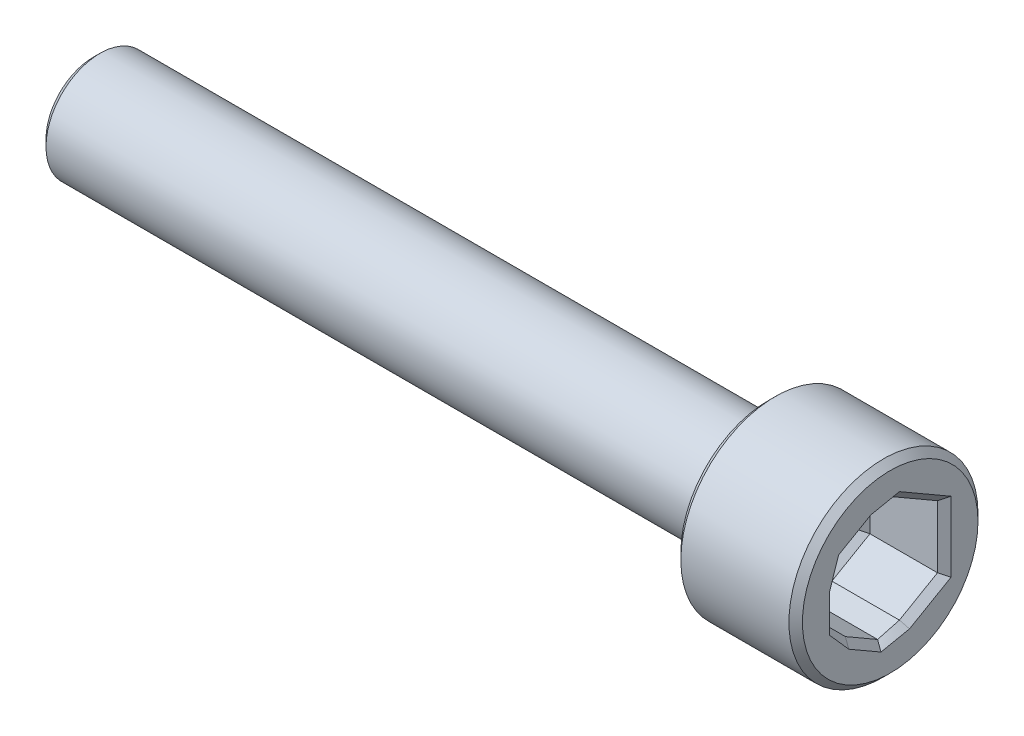
ISO-10303-21;
HEADER;
FILE_DESCRIPTION(('STEP AP214'),'2;1');
FILE_NAME('part.step','',(''),(''),'','','');
FILE_SCHEMA(('AUTOMOTIVE_DESIGN { 1 0 10303 214 1 1 1 1 }'));
ENDSEC;
DATA;
#1=APPLICATION_CONTEXT('core data for automotive mechanical design processes');
#2=APPLICATION_PROTOCOL_DEFINITION('international standard','automotive_design',2000,#1);
#3=PRODUCT_CONTEXT('',#1,'mechanical');
#4=PRODUCT('Part','Part','',(#3));
#5=PRODUCT_RELATED_PRODUCT_CATEGORY('part','',(#4));
#6=PRODUCT_DEFINITION_FORMATION('','',#4);
#7=PRODUCT_DEFINITION_CONTEXT('part definition',#1,'design');
#8=PRODUCT_DEFINITION('design','',#6,#7);
#9=PRODUCT_DEFINITION_SHAPE('','',#8);
#10=(LENGTH_UNIT() NAMED_UNIT(*) SI_UNIT(.MILLI.,.METRE.));
#11=(NAMED_UNIT(*) PLANE_ANGLE_UNIT() SI_UNIT($,.RADIAN.));
#12=(NAMED_UNIT(*) SI_UNIT($,.STERADIAN.) SOLID_ANGLE_UNIT());
#13=UNCERTAINTY_MEASURE_WITH_UNIT(LENGTH_MEASURE(1.E-05),#10,'distance_accuracy_value','');
#14=(GEOMETRIC_REPRESENTATION_CONTEXT(3) GLOBAL_UNCERTAINTY_ASSIGNED_CONTEXT((#13)) GLOBAL_UNIT_ASSIGNED_CONTEXT((#10,
#11,#12)) REPRESENTATION_CONTEXT('',''));
#15=CARTESIAN_POINT('',(0.,0.,0.));
#16=DIRECTION('',(0.,0.,1.));
#17=DIRECTION('',(1.,0.,0.));
#18=AXIS2_PLACEMENT_3D('',#15,#16,#17);
#19=CARTESIAN_POINT('',(0.,0.,-3.5));
#20=DIRECTION('',(1.,0.,0.));
#21=DIRECTION('',(0.,0.,-1.));
#22=AXIS2_PLACEMENT_3D('',#19,#20,#21);
#23=PLANE('',#22);
#24=DIRECTION('',(0.,-1.,0.));
#25=VECTOR('',#24,1.);
#26=CARTESIAN_POINT('',(0.,-1.15470053837925,-2.25));
#27=LINE('',#26,#25);
#28=CARTESIAN_POINT('',(0.,1.29903810567666,-2.25));
#29=VERTEX_POINT('',#28);
#30=CARTESIAN_POINT('',(0.,-1.29903810567666,-2.25));
#31=VERTEX_POINT('',#30);
#32=EDGE_CURVE('E261',#29,#31,#27,.T.);
#33=ORIENTED_EDGE('',*,*,#32,.T.);
#34=DIRECTION('',(0.,-0.5,0.866025403784439));
#35=VECTOR('',#34,1.);
#36=CARTESIAN_POINT('',(0.,-2.52590742770461,-0.124999999999999));
#37=LINE('',#36,#35);
#38=CARTESIAN_POINT('',(0.,-2.18440107675849,-0.716506350946128));
#39=VERTEX_POINT('',#38);
#40=EDGE_CURVE('E269',#31,#39,#37,.T.);
#41=ORIENTED_EDGE('',*,*,#40,.T.);
#42=CARTESIAN_POINT('',(0.,-2.40090742770461,0.341506350946112));
#43=CARTESIAN_POINT('',(0.,-2.37728058948551,0.22604786747843));
#44=CARTESIAN_POINT('',(0.,-2.35365375126641,0.110589384010747));
#45=CARTESIAN_POINT('',(0.,-2.30575594033251,-0.123475308038468));
#46=CARTESIAN_POINT('',(0.,-2.28148496761771,-0.24208151662));
#47=CARTESIAN_POINT('',(0.,-2.2329430221881,-0.479293933783064));
#48=CARTESIAN_POINT('',(0.,-2.2086720494733,-0.597900142364596));
#49=CARTESIAN_POINT('',(0.,-2.18440107675849,-0.716506350946128));
#50=B_SPLINE_CURVE_WITH_KNOTS('',3,(#42,#43,#44,#45,#46,#47,#48,#49),.UNSPECIFIED.,.F.,.F.,(4,2,
2,4),(0.,0.353553390593272,0.7167456474979,1.07993790440253),.UNSPECIFIED.);
#51=CARTESIAN_POINT('',(0.,-2.40090742770461,0.341506350946112));
#52=VERTEX_POINT('',#51);
#53=EDGE_CURVE('E263',#52,#39,#50,.T.);
#54=ORIENTED_EDGE('',*,*,#53,.F.);
#55=DIRECTION('',(0.,0.5,0.866025403784439));
#56=VECTOR('',#55,1.);
#57=CARTESIAN_POINT('',(0.,-1.37120688932536,2.125));
#58=LINE('',#57,#56);
#59=CARTESIAN_POINT('',(0.,-1.71271324027148,1.53349364905388));
#60=VERTEX_POINT('',#59);
#61=EDGE_CURVE('E249',#52,#60,#58,.T.);
#62=ORIENTED_EDGE('',*,*,#61,.T.);
#63=CARTESIAN_POINT('',(0.,-0.90470053837925,2.25));
#64=CARTESIAN_POINT('',(0.,-0.992877099035139,2.17180931615731));
#65=CARTESIAN_POINT('',(0.,-1.08105365969103,2.09361863231463));
#66=CARTESIAN_POINT('',(0.,-1.25981072366768,1.9351055652356));
#67=CARTESIAN_POINT('',(0.,-1.35039122698844,1.85478318199925));
#68=CARTESIAN_POINT('',(0.,-1.53155223362996,1.69413841552657));
#69=CARTESIAN_POINT('',(0.,-1.62213273695072,1.61381603229022));
#70=CARTESIAN_POINT('',(0.,-1.71271324027148,1.53349364905388));
#71=B_SPLINE_CURVE_WITH_KNOTS('',3,(#63,#64,#65,#66,#67,#68,#69,#70),.UNSPECIFIED.,.F.,.F.,(4,2,
2,4),(0.,0.353553390593271,0.716745647497895,1.07993790440252),.UNSPECIFIED.);
#72=CARTESIAN_POINT('',(0.,-0.90470053837925,2.25));
#73=VERTEX_POINT('',#72);
#74=EDGE_CURVE('E243',#73,#60,#71,.T.);
#75=ORIENTED_EDGE('',*,*,#74,.F.);
#76=DIRECTION('',(0.,1.,0.));
#77=VECTOR('',#76,1.);
#78=CARTESIAN_POINT('',(0.,1.15470053837925,2.25));
#79=LINE('',#78,#77);
#80=CARTESIAN_POINT('',(0.,0.471687836487016,2.25));
#81=VERTEX_POINT('',#80);
#82=EDGE_CURVE('E216',#73,#81,#79,.T.);
#83=ORIENTED_EDGE('',*,*,#82,.T.);
#84=CARTESIAN_POINT('',(0.,1.49620688932536,1.90849364905389));
#85=CARTESIAN_POINT('',(0.,1.38440349045037,1.94576144867889));
#86=CARTESIAN_POINT('',(0.,1.27260009157538,1.98302924830388));
#87=CARTESIAN_POINT('',(0.,1.04594521666483,2.05858087327406));
#88=CARTESIAN_POINT('',(0.,0.931093740629269,2.09686469861925));
#89=CARTESIAN_POINT('',(0.,0.701390788558143,2.17343234930963));
#90=CARTESIAN_POINT('',(0.,0.586539312522579,2.21171617465481));
#91=CARTESIAN_POINT('',(0.,0.471687836487016,2.25));
#92=B_SPLINE_CURVE_WITH_KNOTS('',3,(#84,#85,#86,#87,#88,#89,#90,#91),.UNSPECIFIED.,.F.,.F.,(4,2,
2,4),(0.,0.353553390593272,0.716745647497897,1.07993790440252),.UNSPECIFIED.);
#93=CARTESIAN_POINT('',(0.,1.49620688932536,1.90849364905389));
#94=VERTEX_POINT('',#93);
#95=EDGE_CURVE('E208',#94,#81,#92,.T.);
#96=ORIENTED_EDGE('',*,*,#95,.F.);
#97=DIRECTION('',(0.,0.5,-0.866025403784439));
#98=VECTOR('',#97,1.);
#99=CARTESIAN_POINT('',(0.,2.52590742770461,0.125));
#100=LINE('',#99,#98);
#101=CARTESIAN_POINT('',(0.,2.1844010767585,0.716506350946118));
#102=VERTEX_POINT('',#101);
#103=EDGE_CURVE('E250',#94,#102,#100,.T.);
#104=ORIENTED_EDGE('',*,*,#103,.T.);
#105=CARTESIAN_POINT('',(0.,2.40090742770461,-0.341506350946108));
#106=CARTESIAN_POINT('',(0.,2.37728058948551,-0.226047867478425));
#107=CARTESIAN_POINT('',(0.,2.35365375126641,-0.110589384010742));
#108=CARTESIAN_POINT('',(0.,2.30575594033251,0.123475308038471));
#109=CARTESIAN_POINT('',(0.,2.28148496761771,0.24208151662));
#110=CARTESIAN_POINT('',(0.,2.2329430221881,0.479293933783059));
#111=CARTESIAN_POINT('',(0.,2.2086720494733,0.597900142364589));
#112=CARTESIAN_POINT('',(0.,2.1844010767585,0.716506350946118));
#113=B_SPLINE_CURVE_WITH_KNOTS('',3,(#105,#106,#107,#108,#109,#110,#111,#112),.UNSPECIFIED.,.F.,
.F.,(4,2,2,4),(0.,0.353553390593272,0.716745647497892,1.07993790440251),.UNSPECIFIED.);
#114=CARTESIAN_POINT('',(0.,2.40090742770461,-0.341506350946108));
#115=VERTEX_POINT('',#114);
#116=EDGE_CURVE('E253',#115,#102,#113,.T.);
#117=ORIENTED_EDGE('',*,*,#116,.F.);
#118=DIRECTION('',(0.,-0.5,-0.866025403784439));
#119=VECTOR('',#118,1.);
#120=CARTESIAN_POINT('',(0.,1.37120688932536,-2.125));
#121=LINE('',#120,#119);
#122=EDGE_CURVE('E259',#115,#29,#121,.T.);
#123=ORIENTED_EDGE('',*,*,#122,.T.);
#124=EDGE_LOOP('',(#33,#41,#54,#62,#75,#83,#96,#104,#117,#123));
#125=FACE_BOUND('',#124,.T.);
#126=CARTESIAN_POINT('',(0.,0.,0.));
#127=DIRECTION('',(1.,0.,0.));
#128=DIRECTION('',(0.,0.,-1.));
#129=AXIS2_PLACEMENT_3D('',#126,#127,#128);
#130=CIRCLE('',#129,3.25);
#131=CARTESIAN_POINT('',(0.,0.,-3.25));
#132=VERTEX_POINT('',#131);
#133=EDGE_CURVE('E205',#132,#132,#130,.T.);
#134=ORIENTED_EDGE('',*,*,#133,.T.);
#135=EDGE_LOOP('',(#134));
#136=FACE_BOUND('',#135,.T.);
#137=ADVANCED_FACE('F32',(#125,#136),#23,.T.);
#138=CARTESIAN_POINT('',(-29.5,0.,0.));
#139=DIRECTION('',(-1.,0.,0.));
#140=DIRECTION('',(0.,0.,1.));
#141=AXIS2_PLACEMENT_3D('',#138,#139,#140);
#142=PLANE('',#141);
#143=CARTESIAN_POINT('',(-29.5,0.,0.));
#144=DIRECTION('',(-1.,0.,0.));
#145=DIRECTION('',(0.,0.,1.));
#146=AXIS2_PLACEMENT_3D('',#143,#144,#145);
#147=CIRCLE('',#146,1.75);
#148=CARTESIAN_POINT('',(-29.5,0.,1.75000000000001));
#149=VERTEX_POINT('',#148);
#150=EDGE_CURVE('E11',#149,#149,#147,.T.);
#151=ORIENTED_EDGE('',*,*,#150,.T.);
#152=EDGE_LOOP('',(#151));
#153=FACE_BOUND('',#152,.T.);
#154=ADVANCED_FACE('F458',(#153),#142,.T.);
#155=CARTESIAN_POINT('',(0.,0.,0.));
#156=DIRECTION('',(1.,0.,0.));
#157=DIRECTION('',(0.,0.,-1.));
#158=AXIS2_PLACEMENT_3D('',#155,#156,#157);
#159=CYLINDRICAL_SURFACE('',#158,2.);
#160=CARTESIAN_POINT('',(-4.75,0.,0.));
#161=DIRECTION('',(-1.,0.,0.));
#162=DIRECTION('',(0.,0.,1.));
#163=AXIS2_PLACEMENT_3D('',#160,#161,#162);
#164=CIRCLE('',#163,2.);
#165=CARTESIAN_POINT('',(-4.75,0.,2.));
#166=VERTEX_POINT('',#165);
#167=EDGE_CURVE('E41',#166,#166,#164,.T.);
#168=ORIENTED_EDGE('',*,*,#167,.T.);
#169=EDGE_LOOP('',(#168));
#170=FACE_BOUND('',#169,.T.);
#171=CARTESIAN_POINT('',(-29.25,0.,0.));
#172=DIRECTION('',(-1.,0.,0.));
#173=DIRECTION('',(0.,0.,1.));
#174=AXIS2_PLACEMENT_3D('',#171,#172,#173);
#175=CIRCLE('',#174,2.);
#176=CARTESIAN_POINT('',(-29.25,0.,2.));
#177=VERTEX_POINT('',#176);
#178=EDGE_CURVE('E538',#177,#177,#175,.F.);
#179=ORIENTED_EDGE('',*,*,#178,.T.);
#180=EDGE_LOOP('',(#179));
#181=FACE_BOUND('',#180,.T.);
#182=ADVANCED_FACE('F463',(#170,#181),#159,.T.);
#183=CARTESIAN_POINT('',(-4.5,0.,-2.));
#184=DIRECTION('',(-1.,0.,0.));
#185=DIRECTION('',(0.,0.,1.));
#186=AXIS2_PLACEMENT_3D('',#183,#184,#185);
#187=PLANE('',#186);
#188=CARTESIAN_POINT('',(-4.5,0.,0.));
#189=DIRECTION('',(-1.,0.,0.));
#190=DIRECTION('',(0.,0.,1.));
#191=AXIS2_PLACEMENT_3D('',#188,#189,#190);
#192=CIRCLE('',#191,3.25);
#193=CARTESIAN_POINT('',(-4.5,0.,3.25));
#194=VERTEX_POINT('',#193);
#195=EDGE_CURVE('E535',#194,#194,#192,.T.);
#196=ORIENTED_EDGE('',*,*,#195,.T.);
#197=EDGE_LOOP('',(#196));
#198=FACE_BOUND('',#197,.T.);
#199=CARTESIAN_POINT('',(-4.5,0.,0.));
#200=DIRECTION('',(-1.,0.,0.));
#201=DIRECTION('',(0.,0.,1.));
#202=AXIS2_PLACEMENT_3D('',#199,#200,#201);
#203=CIRCLE('',#202,2.25);
#204=CARTESIAN_POINT('',(-4.5,0.,2.25));
#205=VERTEX_POINT('',#204);
#206=EDGE_CURVE('E532',#205,#205,#203,.F.);
#207=ORIENTED_EDGE('',*,*,#206,.T.);
#208=EDGE_LOOP('',(#207));
#209=FACE_BOUND('',#208,.T.);
#210=ADVANCED_FACE('F846',(#198,#209),#187,.T.);
#211=CARTESIAN_POINT('',(0.,0.,0.));
#212=DIRECTION('',(1.,0.,0.));
#213=DIRECTION('',(0.,0.,-1.));
#214=AXIS2_PLACEMENT_3D('',#211,#212,#213);
#215=CYLINDRICAL_SURFACE('',#214,3.5);
#216=CARTESIAN_POINT('',(-0.249999999999999,0.,0.));
#217=DIRECTION('',(1.,0.,0.));
#218=DIRECTION('',(0.,0.,-1.));
#219=AXIS2_PLACEMENT_3D('',#216,#217,#218);
#220=CIRCLE('',#219,3.5);
#221=CARTESIAN_POINT('',(-0.25,0.,-3.5));
#222=VERTEX_POINT('',#221);
#223=EDGE_CURVE('E529',#222,#222,#220,.F.);
#224=ORIENTED_EDGE('',*,*,#223,.T.);
#225=EDGE_LOOP('',(#224));
#226=FACE_BOUND('',#225,.T.);
#227=CARTESIAN_POINT('',(-4.25000000000001,0.,0.));
#228=DIRECTION('',(-1.,0.,0.));
#229=DIRECTION('',(0.,0.,1.));
#230=AXIS2_PLACEMENT_3D('',#227,#228,#229);
#231=CIRCLE('',#230,3.5);
#232=CARTESIAN_POINT('',(-4.25000000000001,0.,3.5));
#233=VERTEX_POINT('',#232);
#234=EDGE_CURVE('E526',#233,#233,#231,.F.);
#235=ORIENTED_EDGE('',*,*,#234,.T.);
#236=EDGE_LOOP('',(#235));
#237=FACE_BOUND('',#236,.T.);
#238=ADVANCED_FACE('F838',(#226,#237),#215,.T.);
#239=CARTESIAN_POINT('',(-3.,-1.15470053837925,2.));
#240=DIRECTION('',(0.,-0.866025403784439,0.5));
#241=DIRECTION('',(0.,-0.5,-0.866025403784439));
#242=AXIS2_PLACEMENT_3D('',#239,#240,#241);
#243=PLANE('',#242);
#244=DIRECTION('',(0.,-0.5,-0.866025403784439));
#245=VECTOR('',#244,1.);
#246=CARTESIAN_POINT('',(-0.249999999999996,-2.3094010767585,0.));
#247=LINE('',#246,#245);
#248=CARTESIAN_POINT('',(-0.249999999999995,-1.49620688932537,1.40849364905388));
#249=VERTEX_POINT('',#248);
#250=CARTESIAN_POINT('',(-0.249999999999995,-2.1844010767585,0.216506350946112));
#251=VERTEX_POINT('',#250);
#252=EDGE_CURVE('E171',#249,#251,#247,.T.);
#253=ORIENTED_EDGE('',*,*,#252,.T.);
#254=DIRECTION('',(-1.,0.,0.));
#255=VECTOR('',#254,1.);
#256=CARTESIAN_POINT('',(-3.,-2.1844010767585,0.216506350946113));
#257=LINE('',#256,#255);
#258=CARTESIAN_POINT('',(-2.75,-2.1844010767585,0.216506350946113));
#259=VERTEX_POINT('',#258);
#260=EDGE_CURVE('E169',#251,#259,#257,.T.);
#261=ORIENTED_EDGE('',*,*,#260,.T.);
#262=DIRECTION('',(0.,0.5,0.866025403784439));
#263=VECTOR('',#262,1.);
#264=CARTESIAN_POINT('',(-2.75,-1.15470053837925,2.));
#265=LINE('',#264,#263);
#266=CARTESIAN_POINT('',(-2.75,-1.49620688932537,1.40849364905388));
#267=VERTEX_POINT('',#266);
#268=EDGE_CURVE('E161',#259,#267,#265,.T.);
#269=ORIENTED_EDGE('',*,*,#268,.T.);
#270=DIRECTION('',(1.,0.,0.));
#271=VECTOR('',#270,1.);
#272=CARTESIAN_POINT('',(0.,-1.49620688932537,1.40849364905388));
#273=LINE('',#272,#271);
#274=EDGE_CURVE('E166',#267,#249,#273,.T.);
#275=ORIENTED_EDGE('',*,*,#274,.T.);
#276=EDGE_LOOP('',(#253,#261,#269,#275));
#277=FACE_BOUND('',#276,.T.);
#278=ADVANCED_FACE('F164',(#277),#243,.F.);
#279=CARTESIAN_POINT('',(-3.,1.15470053837925,2.));
#280=DIRECTION('',(0.,0.,1.));
#281=DIRECTION('',(1.,0.,0.));
#282=AXIS2_PLACEMENT_3D('',#279,#280,#281);
#283=PLANE('',#282);
#284=DIRECTION('',(0.,1.,0.));
#285=VECTOR('',#284,1.);
#286=CARTESIAN_POINT('',(-2.75,1.15470053837925,2.));
#287=LINE('',#286,#285);
#288=CARTESIAN_POINT('',(-2.75,-0.90470053837925,2.));
#289=VERTEX_POINT('',#288);
#290=CARTESIAN_POINT('',(-2.75,0.471687836487016,2.));
#291=VERTEX_POINT('',#290);
#292=EDGE_CURVE('E509',#289,#291,#287,.T.);
#293=ORIENTED_EDGE('',*,*,#292,.T.);
#294=DIRECTION('',(1.,0.,0.));
#295=VECTOR('',#294,1.);
#296=CARTESIAN_POINT('',(0.,0.471687836487016,2.));
#297=LINE('',#296,#295);
#298=CARTESIAN_POINT('',(-0.249999999999995,0.471687836487016,2.));
#299=VERTEX_POINT('',#298);
#300=EDGE_CURVE('E514',#291,#299,#297,.T.);
#301=ORIENTED_EDGE('',*,*,#300,.T.);
#302=DIRECTION('',(0.,-1.,0.));
#303=VECTOR('',#302,1.);
#304=CARTESIAN_POINT('',(-0.249999999999995,-1.15470053837925,2.));
#305=LINE('',#304,#303);
#306=CARTESIAN_POINT('',(-0.249999999999995,-0.90470053837925,2.));
#307=VERTEX_POINT('',#306);
#308=EDGE_CURVE('E511',#299,#307,#305,.T.);
#309=ORIENTED_EDGE('',*,*,#308,.T.);
#310=DIRECTION('',(-1.,0.,0.));
#311=VECTOR('',#310,1.);
#312=CARTESIAN_POINT('',(-3.,-0.90470053837925,2.));
#313=LINE('',#312,#311);
#314=EDGE_CURVE('E507',#307,#289,#313,.T.);
#315=ORIENTED_EDGE('',*,*,#314,.T.);
#316=EDGE_LOOP('',(#293,#301,#309,#315));
#317=FACE_BOUND('',#316,.T.);
#318=ADVANCED_FACE('F594',(#317),#283,.F.);
#319=CARTESIAN_POINT('',(-3.,2.3094010767585,0.));
#320=DIRECTION('',(0.,0.866025403784438,0.5));
#321=DIRECTION('',(0.,-0.5,0.866025403784439));
#322=AXIS2_PLACEMENT_3D('',#319,#320,#321);
#323=PLANE('',#322);
#324=DIRECTION('',(0.,0.5,-0.866025403784439));
#325=VECTOR('',#324,1.);
#326=CARTESIAN_POINT('',(-2.75,2.3094010767585,0.));
#327=LINE('',#326,#325);
#328=CARTESIAN_POINT('',(-2.75,1.27970053837925,1.78349364905389));
#329=VERTEX_POINT('',#328);
#330=CARTESIAN_POINT('',(-2.75,1.96789472581239,0.591506350946118));
#331=VERTEX_POINT('',#330);
#332=EDGE_CURVE('E500',#329,#331,#327,.T.);
#333=ORIENTED_EDGE('',*,*,#332,.T.);
#334=DIRECTION('',(1.,0.,0.));
#335=VECTOR('',#334,1.);
#336=CARTESIAN_POINT('',(0.,1.96789472581239,0.591506350946118));
#337=LINE('',#336,#335);
#338=CARTESIAN_POINT('',(-0.249999999999996,1.96789472581239,0.591506350946118));
#339=VERTEX_POINT('',#338);
#340=EDGE_CURVE('E505',#331,#339,#337,.T.);
#341=ORIENTED_EDGE('',*,*,#340,.T.);
#342=DIRECTION('',(0.,-0.5,0.866025403784439));
#343=VECTOR('',#342,1.);
#344=CARTESIAN_POINT('',(-0.249999999999995,1.15470053837925,2.));
#345=LINE('',#344,#343);
#346=CARTESIAN_POINT('',(-0.249999999999995,1.27970053837925,1.78349364905389));
#347=VERTEX_POINT('',#346);
#348=EDGE_CURVE('E502',#339,#347,#345,.T.);
#349=ORIENTED_EDGE('',*,*,#348,.T.);
#350=DIRECTION('',(-1.,0.,0.));
#351=VECTOR('',#350,1.);
#352=CARTESIAN_POINT('',(-3.,1.27970053837925,1.78349364905389));
#353=LINE('',#352,#351);
#354=EDGE_CURVE('E498',#347,#329,#353,.T.);
#355=ORIENTED_EDGE('',*,*,#354,.T.);
#356=EDGE_LOOP('',(#333,#341,#349,#355));
#357=FACE_BOUND('',#356,.T.);
#358=ADVANCED_FACE('F564',(#357),#323,.F.);
#359=CARTESIAN_POINT('',(-3.,1.15470053837925,-2.));
#360=DIRECTION('',(0.,0.866025403784439,-0.5));
#361=DIRECTION('',(0.,0.5,0.866025403784439));
#362=AXIS2_PLACEMENT_3D('',#359,#360,#361);
#363=PLANE('',#362);
#364=DIRECTION('',(1.,0.,0.));
#365=VECTOR('',#364,1.);
#366=CARTESIAN_POINT('',(-3.,1.15470053837925,-2.));
#367=LINE('',#366,#365);
#368=CARTESIAN_POINT('',(-2.75,1.15470053837925,-2.));
#369=VERTEX_POINT('',#368);
#370=CARTESIAN_POINT('',(-0.249999999999996,1.15470053837925,-2.));
#371=VERTEX_POINT('',#370);
#372=EDGE_CURVE('E196',#369,#371,#367,.T.);
#373=ORIENTED_EDGE('',*,*,#372,.T.);
#374=DIRECTION('',(0.,0.5,0.866025403784439));
#375=VECTOR('',#374,1.);
#376=CARTESIAN_POINT('',(-0.249999999999996,2.3094010767585,0.));
#377=LINE('',#376,#375);
#378=CARTESIAN_POINT('',(-0.249999999999996,2.1844010767585,-0.216506350946107));
#379=VERTEX_POINT('',#378);
#380=EDGE_CURVE('E496',#371,#379,#377,.T.);
#381=ORIENTED_EDGE('',*,*,#380,.T.);
#382=DIRECTION('',(-1.,0.,0.));
#383=VECTOR('',#382,1.);
#384=CARTESIAN_POINT('',(-3.,2.1844010767585,-0.216506350946107));
#385=LINE('',#384,#383);
#386=CARTESIAN_POINT('',(-2.75,2.1844010767585,-0.216506350946107));
#387=VERTEX_POINT('',#386);
#388=EDGE_CURVE('E492',#379,#387,#385,.T.);
#389=ORIENTED_EDGE('',*,*,#388,.T.);
#390=DIRECTION('',(0.,-0.5,-0.866025403784439));
#391=VECTOR('',#390,1.);
#392=CARTESIAN_POINT('',(-2.75,1.15470053837925,-2.));
#393=LINE('',#392,#391);
#394=EDGE_CURVE('E494',#387,#369,#393,.T.);
#395=ORIENTED_EDGE('',*,*,#394,.T.);
#396=EDGE_LOOP('',(#373,#381,#389,#395));
#397=FACE_BOUND('',#396,.T.);
#398=ADVANCED_FACE('F807',(#397),#363,.F.);
#399=CARTESIAN_POINT('',(-3.,-1.15470053837925,-2.));
#400=DIRECTION('',(0.,0.,-1.));
#401=DIRECTION('',(0.,1.,0.));
#402=AXIS2_PLACEMENT_3D('',#399,#400,#401);
#403=PLANE('',#402);
#404=DIRECTION('',(1.,0.,0.));
#405=VECTOR('',#404,1.);
#406=CARTESIAN_POINT('',(-3.,-1.15470053837925,-2.));
#407=LINE('',#406,#405);
#408=CARTESIAN_POINT('',(-2.75,-1.15470053837925,-2.));
#409=VERTEX_POINT('',#408);
#410=CARTESIAN_POINT('',(-0.249999999999996,-1.15470053837925,-2.));
#411=VERTEX_POINT('',#410);
#412=EDGE_CURVE('E199',#409,#411,#407,.T.);
#413=ORIENTED_EDGE('',*,*,#412,.T.);
#414=DIRECTION('',(0.,1.,0.));
#415=VECTOR('',#414,1.);
#416=CARTESIAN_POINT('',(-0.249999999999996,1.15470053837925,-2.));
#417=LINE('',#416,#415);
#418=EDGE_CURVE('E477',#411,#371,#417,.T.);
#419=ORIENTED_EDGE('',*,*,#418,.T.);
#420=ORIENTED_EDGE('',*,*,#372,.F.);
#421=DIRECTION('',(0.,-1.,0.));
#422=VECTOR('',#421,1.);
#423=CARTESIAN_POINT('',(-2.75,-1.15470053837925,-2.));
#424=LINE('',#423,#422);
#425=EDGE_CURVE('E489',#369,#409,#424,.T.);
#426=ORIENTED_EDGE('',*,*,#425,.T.);
#427=EDGE_LOOP('',(#413,#419,#420,#426));
#428=FACE_BOUND('',#427,.T.);
#429=ADVANCED_FACE('F799',(#428),#403,.F.);
#430=CARTESIAN_POINT('',(-3.,-2.3094010767585,0.));
#431=DIRECTION('',(0.,-0.866025403784439,-0.5));
#432=DIRECTION('',(0.,0.5,-0.866025403784439));
#433=AXIS2_PLACEMENT_3D('',#430,#431,#432);
#434=PLANE('',#433);
#435=DIRECTION('',(1.,0.,0.));
#436=VECTOR('',#435,1.);
#437=CARTESIAN_POINT('',(0.,-1.96789472581238,-0.591506350946128));
#438=LINE('',#437,#436);
#439=CARTESIAN_POINT('',(-2.75,-1.96789472581238,-0.591506350946127));
#440=VERTEX_POINT('',#439);
#441=CARTESIAN_POINT('',(-0.249999999999997,-1.96789472581238,-0.591506350946128));
#442=VERTEX_POINT('',#441);
#443=EDGE_CURVE('E481',#440,#442,#438,.T.);
#444=ORIENTED_EDGE('',*,*,#443,.T.);
#445=DIRECTION('',(0.,0.5,-0.866025403784439));
#446=VECTOR('',#445,1.);
#447=CARTESIAN_POINT('',(-0.249999999999997,-1.15470053837925,-2.));
#448=LINE('',#447,#446);
#449=EDGE_CURVE('E485',#442,#411,#448,.T.);
#450=ORIENTED_EDGE('',*,*,#449,.T.);
#451=ORIENTED_EDGE('',*,*,#412,.F.);
#452=DIRECTION('',(0.,-0.5,0.866025403784439));
#453=VECTOR('',#452,1.);
#454=CARTESIAN_POINT('',(-2.75,-2.3094010767585,0.));
#455=LINE('',#454,#453);
#456=EDGE_CURVE('E482',#409,#440,#455,.T.);
#457=ORIENTED_EDGE('',*,*,#456,.T.);
#458=EDGE_LOOP('',(#444,#450,#451,#457));
#459=FACE_BOUND('',#458,.T.);
#460=ADVANCED_FACE('F791',(#459),#434,.F.);
#461=CARTESIAN_POINT('',(-3.,0.,0.));
#462=DIRECTION('',(1.,0.,0.));
#463=DIRECTION('',(0.,0.,-1.));
#464=AXIS2_PLACEMENT_3D('',#461,#462,#463);
#465=PLANE('',#464);
#466=DIRECTION('',(0.,-1.,0.));
#467=VECTOR('',#466,1.);
#468=CARTESIAN_POINT('',(-3.,0.,1.75));
#469=LINE('',#468,#467);
#470=CARTESIAN_POINT('',(-3.,1.01036297108184,1.75));
#471=VERTEX_POINT('',#470);
#472=CARTESIAN_POINT('',(-3.,-1.01036297108184,1.75));
#473=VERTEX_POINT('',#472);
#474=EDGE_CURVE('E516',#471,#473,#469,.T.);
#475=ORIENTED_EDGE('',*,*,#474,.T.);
#476=DIRECTION('',(0.,-0.5,-0.866025403784439));
#477=VECTOR('',#476,1.);
#478=CARTESIAN_POINT('',(-3.,-1.51554445662277,0.874999999999999));
#479=LINE('',#478,#477);
#480=CARTESIAN_POINT('',(-3.,-2.02072594216369,0.));
#481=VERTEX_POINT('',#480);
#482=EDGE_CURVE('E178',#473,#481,#479,.T.);
#483=ORIENTED_EDGE('',*,*,#482,.T.);
#484=DIRECTION('',(0.,0.5,-0.866025403784439));
#485=VECTOR('',#484,1.);
#486=CARTESIAN_POINT('',(-3.,-1.51554445662276,-0.874999999999998));
#487=LINE('',#486,#485);
#488=CARTESIAN_POINT('',(-3.,-1.01036297108184,-1.75));
#489=VERTEX_POINT('',#488);
#490=EDGE_CURVE('E57',#481,#489,#487,.T.);
#491=ORIENTED_EDGE('',*,*,#490,.T.);
#492=DIRECTION('',(0.,1.,0.));
#493=VECTOR('',#492,1.);
#494=CARTESIAN_POINT('',(-3.,0.,-1.75));
#495=LINE('',#494,#493);
#496=CARTESIAN_POINT('',(-3.,1.01036297108184,-1.75));
#497=VERTEX_POINT('',#496);
#498=EDGE_CURVE('E522',#489,#497,#495,.T.);
#499=ORIENTED_EDGE('',*,*,#498,.T.);
#500=DIRECTION('',(0.,0.5,0.866025403784439));
#501=VECTOR('',#500,1.);
#502=CARTESIAN_POINT('',(-3.,1.51554445662276,-0.874999999999998));
#503=LINE('',#502,#501);
#504=CARTESIAN_POINT('',(-3.,2.02072594216369,0.));
#505=VERTEX_POINT('',#504);
#506=EDGE_CURVE('E520',#497,#505,#503,.T.);
#507=ORIENTED_EDGE('',*,*,#506,.T.);
#508=DIRECTION('',(0.,-0.5,0.866025403784439));
#509=VECTOR('',#508,1.);
#510=CARTESIAN_POINT('',(-3.,1.51554445662276,0.874999999999999));
#511=LINE('',#510,#509);
#512=EDGE_CURVE('E518',#505,#471,#511,.T.);
#513=ORIENTED_EDGE('',*,*,#512,.T.);
#514=EDGE_LOOP('',(#475,#483,#491,#499,#507,#513));
#515=FACE_BOUND('',#514,.T.);
#516=ADVANCED_FACE('F440',(#515),#465,.T.);
#517=CARTESIAN_POINT('',(-3.,2.02072594216369,0.));
#518=DIRECTION('',(0.377964473009238,-0.894273544867824,-0.239619874159856));
#519=DIRECTION('',(0.921108392914562,0.389306214312529,0.));
#520=AXIS2_PLACEMENT_3D('',#517,#518,#519);
#521=PLANE('',#520);
#522=DIRECTION('',(0.,0.258819045102526,-0.965925826289067));
#523=VECTOR('',#522,1.);
#524=CARTESIAN_POINT('',(-2.75,2.11931033398804,0.0264156081756506));
#525=LINE('',#524,#523);
#526=EDGE_CURVE('E914',#331,#387,#525,.T.);
#527=ORIENTED_EDGE('',*,*,#526,.F.);
#528=DIRECTION('',(-0.387995381130104,0.0819930716951519,-0.918006928304846));
#529=VECTOR('',#528,1.);
#530=CARTESIAN_POINT('',(-3.,2.02072594216369,0.));
#531=LINE('',#530,#529);
#532=EDGE_CURVE('E36',#505,#331,#531,.F.);
#533=ORIENTED_EDGE('',*,*,#532,.F.);
#534=DIRECTION('',(0.677497944020812,0.443558268701271,-0.586730430533737));
#535=VECTOR('',#534,1.);
#536=CARTESIAN_POINT('',(-3.,2.02072594216369,0.));
#537=LINE('',#536,#535);
#538=EDGE_CURVE('E911',#387,#505,#537,.F.);
#539=ORIENTED_EDGE('',*,*,#538,.F.);
#540=EDGE_LOOP('',(#527,#533,#539));
#541=FACE_BOUND('',#540,.T.);
#542=ADVANCED_FACE('F436',(#541),#521,.T.);
#543=CARTESIAN_POINT('',(-3.,1.51554445662276,0.874999999999999));
#544=DIRECTION('',(-0.707106781186547,0.612372435695795,0.353553390593274));
#545=DIRECTION('',(0.,-0.5,0.866025403784439));
#546=AXIS2_PLACEMENT_3D('',#543,#544,#545);
#547=PLANE('',#546);
#548=ORIENTED_EDGE('',*,*,#532,.T.);
#549=ORIENTED_EDGE('',*,*,#332,.F.);
#550=DIRECTION('',(0.67749794402081,0.729902592366235,0.0907675134870649));
#551=VECTOR('',#550,1.);
#552=CARTESIAN_POINT('',(-3.,1.01036297108184,1.75));
#553=LINE('',#552,#551);
#554=EDGE_CURVE('E910',#471,#329,#553,.T.);
#555=ORIENTED_EDGE('',*,*,#554,.F.);
#556=ORIENTED_EDGE('',*,*,#512,.F.);
#557=EDGE_LOOP('',(#548,#549,#555,#556));
#558=FACE_BOUND('',#557,.T.);
#559=ADVANCED_FACE('F432',(#558),#547,.F.);
#560=CARTESIAN_POINT('',(-3.,1.51554445662276,-0.874999999999998));
#561=DIRECTION('',(-0.707106781186548,0.612372435695794,-0.353553390593273));
#562=DIRECTION('',(0.,0.5,0.866025403784439));
#563=AXIS2_PLACEMENT_3D('',#560,#561,#562);
#564=PLANE('',#563);
#565=ORIENTED_EDGE('',*,*,#538,.T.);
#566=ORIENTED_EDGE('',*,*,#506,.F.);
#567=DIRECTION('',(0.654653670707977,0.377964473009228,-0.654653670707977));
#568=VECTOR('',#567,1.);
#569=CARTESIAN_POINT('',(-3.25,0.866025403784437,-1.5));
#570=LINE('',#569,#568);
#571=EDGE_CURVE('E396',#369,#497,#570,.F.);
#572=ORIENTED_EDGE('',*,*,#571,.F.);
#573=ORIENTED_EDGE('',*,*,#394,.F.);
#574=EDGE_LOOP('',(#565,#566,#572,#573));
#575=FACE_BOUND('',#574,.T.);
#576=ADVANCED_FACE('F429',(#575),#564,.F.);
#577=CARTESIAN_POINT('',(-3.,1.96789472581239,0.591506350946118));
#578=DIRECTION('',(0.,-0.965925826289067,-0.258819045102526));
#579=DIRECTION('',(-1.,0.,0.));
#580=AXIS2_PLACEMENT_3D('',#577,#578,#579);
#581=PLANE('',#580);
#582=ORIENTED_EDGE('',*,*,#526,.T.);
#583=ORIENTED_EDGE('',*,*,#388,.F.);
#584=CARTESIAN_POINT('',(-0.249999999999996,1.96789472581239,0.591506350946118));
#585=CARTESIAN_POINT('',(-0.249999999999996,1.99839684279443,0.477670900630749));
#586=CARTESIAN_POINT('',(-0.249999999999996,2.02889895977646,0.36383545031538));
#587=CARTESIAN_POINT('',(-0.249999999999996,2.08023441009183,0.172248941508991));
#588=CARTESIAN_POINT('',(-0.249999999999996,2.10106774342517,0.0944978830179713));
#589=CARTESIAN_POINT('',(-0.249999999999996,2.14273441009184,-0.0610042339640681));
#590=CARTESIAN_POINT('',(-0.249999999999996,2.16356774342517,-0.138755292455088));
#591=CARTESIAN_POINT('',(-0.249999999999996,2.1844010767585,-0.216506350946108));
#592=B_SPLINE_CURVE_WITH_KNOTS('',3,(#584,#585,#586,#587,#588,#589,#590,#591),.UNSPECIFIED.,.F.,
.F.,(4,2,2,4),(0.,0.353553390593272,0.595034847165544,0.836516303737815),.UNSPECIFIED.);
#593=EDGE_CURVE('E388',#339,#379,#592,.T.);
#594=ORIENTED_EDGE('',*,*,#593,.F.);
#595=ORIENTED_EDGE('',*,*,#340,.F.);
#596=EDGE_LOOP('',(#582,#583,#594,#595));
#597=FACE_BOUND('',#596,.T.);
#598=ADVANCED_FACE('F398',(#597),#581,.T.);
#599=CARTESIAN_POINT('',(-3.,1.01036297108184,1.75));
#600=DIRECTION('',(0.377964473009228,-0.239619874159849,-0.89427354486783));
#601=DIRECTION('',(-0.921108392914566,0.,-0.389306214312519));
#602=AXIS2_PLACEMENT_3D('',#599,#600,#601);
#603=PLANE('',#602);
#604=DIRECTION('',(-0.387995381130099,0.836013856609697,-0.387995381130099));
#605=VECTOR('',#604,1.);
#606=CARTESIAN_POINT('',(-3.,1.01036297108184,1.75));
#607=LINE('',#606,#605);
#608=EDGE_CURVE('E379',#471,#291,#607,.F.);
#609=ORIENTED_EDGE('',*,*,#608,.F.);
#610=ORIENTED_EDGE('',*,*,#554,.T.);
#611=DIRECTION('',(0.,0.965925826289069,-0.258819045102517));
#612=VECTOR('',#611,1.);
#613=CARTESIAN_POINT('',(-2.75,1.03677857925749,1.84858439182435));
#614=LINE('',#613,#612);
#615=EDGE_CURVE('E382',#291,#329,#614,.T.);
#616=ORIENTED_EDGE('',*,*,#615,.F.);
#617=EDGE_LOOP('',(#609,#610,#616));
#618=FACE_BOUND('',#617,.T.);
#619=ADVANCED_FACE('F424',(#618),#603,.T.);
#620=CARTESIAN_POINT('',(-3.,0.,-1.75));
#621=DIRECTION('',(-0.707106781186547,0.,-0.707106781186547));
#622=DIRECTION('',(0.,1.,0.));
#623=AXIS2_PLACEMENT_3D('',#620,#621,#622);
#624=PLANE('',#623);
#625=ORIENTED_EDGE('',*,*,#571,.T.);
#626=ORIENTED_EDGE('',*,*,#498,.F.);
#627=DIRECTION('',(0.654653670707977,-0.377964473009227,-0.654653670707977));
#628=VECTOR('',#627,1.);
#629=CARTESIAN_POINT('',(-3.25,-0.866025403784437,-1.5));
#630=LINE('',#629,#628);
#631=EDGE_CURVE('E376',#409,#489,#630,.F.);
#632=ORIENTED_EDGE('',*,*,#631,.F.);
#633=ORIENTED_EDGE('',*,*,#425,.F.);
#634=EDGE_LOOP('',(#625,#626,#632,#633));
#635=FACE_BOUND('',#634,.T.);
#636=ADVANCED_FACE('F415',(#635),#624,.F.);
#637=CARTESIAN_POINT('',(-0.249999999999996,2.1844010767585,-0.216506350946107));
#638=CARTESIAN_POINT('',(-0.249999999999996,1.96789472581239,0.591506350946118));
#639=CARTESIAN_POINT('',(0.,2.40090742770461,-0.341506350946108));
#640=CARTESIAN_POINT('',(0.,2.1844010767585,0.716506350946118));
#641=B_SPLINE_SURFACE_WITH_KNOTS('',1,1,((#637,#638),(#639,#640)),.UNSPECIFIED.,.F.,.F.,.F.,(2,
2),(2,2),(0.,1.),(0.,1.),.UNSPECIFIED.);
#642=DIRECTION('',(0.707106781186543,0.612372435695799,-0.353553390593276));
#643=VECTOR('',#642,1.);
#644=CARTESIAN_POINT('',(-0.249999999999996,2.1844010767585,-0.216506350946107));
#645=LINE('',#644,#643);
#646=EDGE_CURVE('E373',#115,#379,#645,.F.);
#647=DIRECTION('',(-0.707106781186541,-0.6123724356958,-0.353553390593277));
#648=VECTOR('',#647,1.);
#649=CARTESIAN_POINT('',(0.,2.1844010767585,0.716506350946118));
#650=LINE('',#649,#648);
#651=EDGE_CURVE('E385',#339,#102,#650,.F.);
#652=ORIENTED_EDGE('',*,*,#646,.F.);
#653=ORIENTED_EDGE('',*,*,#116,.T.);
#654=ORIENTED_EDGE('',*,*,#651,.F.);
#655=ORIENTED_EDGE('',*,*,#593,.T.);
#656=EDGE_LOOP('',(#652,#653,#654,#655));
#657=FACE_BOUND('',#656,.T.);
#658=ADVANCED_FACE('F405',(#657),#641,.T.);
#659=CARTESIAN_POINT('',(-0.249999999999996,2.3094010767585,0.));
#660=DIRECTION('',(0.707106781186553,-0.612372435695789,-0.353553390593271));
#661=DIRECTION('',(0.,0.5,-0.866025403784439));
#662=AXIS2_PLACEMENT_3D('',#659,#660,#661);
#663=PLANE('',#662);
#664=ORIENTED_EDGE('',*,*,#651,.T.);
#665=ORIENTED_EDGE('',*,*,#103,.F.);
#666=DIRECTION('',(0.707106781186541,0.6123724356958,0.353553390593277));
#667=VECTOR('',#666,1.);
#668=CARTESIAN_POINT('',(-0.249999999999995,1.27970053837925,1.78349364905389));
#669=LINE('',#668,#667);
#670=EDGE_CURVE('E370',#347,#94,#669,.T.);
#671=ORIENTED_EDGE('',*,*,#670,.F.);
#672=ORIENTED_EDGE('',*,*,#348,.F.);
#673=EDGE_LOOP('',(#664,#665,#671,#672));
#674=FACE_BOUND('',#673,.T.);
#675=ADVANCED_FACE('F357',(#674),#663,.T.);
#676=CARTESIAN_POINT('',(-3.,0.471687836487016,2.));
#677=DIRECTION('',(0.,-0.258819045102517,-0.965925826289069));
#678=DIRECTION('',(-1.,0.,0.));
#679=AXIS2_PLACEMENT_3D('',#676,#677,#678);
#680=PLANE('',#679);
#681=ORIENTED_EDGE('',*,*,#615,.T.);
#682=ORIENTED_EDGE('',*,*,#354,.F.);
#683=CARTESIAN_POINT('',(-0.249999999999995,0.471687836487016,2.));
#684=CARTESIAN_POINT('',(-0.249999999999995,0.585523286802386,1.96949788301796));
#685=CARTESIAN_POINT('',(-0.249999999999995,0.699358737117755,1.93899576603593));
#686=CARTESIAN_POINT('',(-0.249999999999995,0.890945245924146,1.88766031572056));
#687=CARTESIAN_POINT('',(-0.249999999999995,0.968696304415167,1.86682698238722));
#688=CARTESIAN_POINT('',(-0.249999999999995,1.12419842139721,1.82516031572056));
#689=CARTESIAN_POINT('',(-0.249999999999995,1.20194947988823,1.80432698238722));
#690=CARTESIAN_POINT('',(-0.249999999999995,1.27970053837925,1.78349364905389));
#691=B_SPLINE_CURVE_WITH_KNOTS('',3,(#683,#684,#685,#686,#687,#688,#689,#690),.UNSPECIFIED.,.F.,
.F.,(4,2,2,4),(0.,0.353553390593272,0.595034847165548,0.836516303737824),.UNSPECIFIED.);
#692=EDGE_CURVE('E364',#299,#347,#691,.T.);
#693=ORIENTED_EDGE('',*,*,#692,.F.);
#694=ORIENTED_EDGE('',*,*,#300,.F.);
#695=EDGE_LOOP('',(#681,#682,#693,#694));
#696=FACE_BOUND('',#695,.T.);
#697=ADVANCED_FACE('F352',(#696),#680,.T.);
#698=CARTESIAN_POINT('',(-3.,0.,1.75));
#699=DIRECTION('',(-0.707106781186547,0.,0.707106781186547));
#700=DIRECTION('',(0.,-1.,0.));
#701=AXIS2_PLACEMENT_3D('',#698,#699,#700);
#702=PLANE('',#701);
#703=ORIENTED_EDGE('',*,*,#608,.T.);
#704=ORIENTED_EDGE('',*,*,#292,.F.);
#705=DIRECTION('',(0.67749794402081,0.286344323664974,0.67749794402081));
#706=VECTOR('',#705,1.);
#707=CARTESIAN_POINT('',(-3.13625433019053,-1.06795082705862,1.61374566980946));
#708=LINE('',#707,#706);
#709=EDGE_CURVE('E182',#473,#289,#708,.T.);
#710=ORIENTED_EDGE('',*,*,#709,.F.);
#711=ORIENTED_EDGE('',*,*,#474,.F.);
#712=EDGE_LOOP('',(#703,#704,#710,#711));
#713=FACE_BOUND('',#712,.T.);
#714=ADVANCED_FACE('F356',(#713),#702,.F.);
#715=CARTESIAN_POINT('',(-3.,-1.51554445662276,0.874999999999999));
#716=DIRECTION('',(-0.707106781186547,-0.612372435695795,0.353553390593274));
#717=DIRECTION('',(0.,-0.5,-0.866025403784439));
#718=AXIS2_PLACEMENT_3D('',#715,#716,#717);
#719=PLANE('',#718);
#720=DIRECTION('',(0.677497944020811,-0.443558268701262,0.586730430533745));
#721=VECTOR('',#720,1.);
#722=CARTESIAN_POINT('',(-3.,-2.02072594216369,0.));
#723=LINE('',#722,#721);
#724=EDGE_CURVE('E183',#481,#259,#723,.T.);
#725=ORIENTED_EDGE('',*,*,#724,.F.);
#726=ORIENTED_EDGE('',*,*,#482,.F.);
#727=DIRECTION('',(-0.3879953811301,0.754020784914539,0.530011547174748));
#728=VECTOR('',#727,1.);
#729=CARTESIAN_POINT('',(-2.75,-1.49620688932537,1.40849364905388));
#730=LINE('',#729,#728);
#731=EDGE_CURVE('E175',#267,#473,#730,.T.);
#732=ORIENTED_EDGE('',*,*,#731,.F.);
#733=ORIENTED_EDGE('',*,*,#268,.F.);
#734=EDGE_LOOP('',(#725,#726,#732,#733));
#735=FACE_BOUND('',#734,.T.);
#736=ADVANCED_FACE('F177',(#735),#719,.F.);
#737=CARTESIAN_POINT('',(-3.,-1.51554445662276,-0.874999999999998));
#738=DIRECTION('',(-0.707106781186547,-0.612372435695795,-0.353553390593274));
#739=DIRECTION('',(0.,0.5,-0.866025403784439));
#740=AXIS2_PLACEMENT_3D('',#737,#738,#739);
#741=PLANE('',#740);
#742=ORIENTED_EDGE('',*,*,#631,.T.);
#743=ORIENTED_EDGE('',*,*,#490,.F.);
#744=DIRECTION('',(-0.387995381130096,-0.0819930716951616,0.918006928304849));
#745=VECTOR('',#744,1.);
#746=CARTESIAN_POINT('',(-3.,-2.02072594216369,0.));
#747=LINE('',#746,#745);
#748=EDGE_CURVE('E49',#440,#481,#747,.T.);
#749=ORIENTED_EDGE('',*,*,#748,.F.);
#750=ORIENTED_EDGE('',*,*,#456,.F.);
#751=EDGE_LOOP('',(#742,#743,#749,#750));
#752=FACE_BOUND('',#751,.T.);
#753=ADVANCED_FACE('F583',(#752),#741,.F.);
#754=CARTESIAN_POINT('',(-0.249999999999996,1.15470053837925,-2.));
#755=DIRECTION('',(0.707106781186552,-0.61237243569579,0.353553390593271));
#756=DIRECTION('',(0.,-0.5,-0.866025403784439));
#757=AXIS2_PLACEMENT_3D('',#754,#755,#756);
#758=PLANE('',#757);
#759=ORIENTED_EDGE('',*,*,#646,.T.);
#760=ORIENTED_EDGE('',*,*,#380,.F.);
#761=DIRECTION('',(0.654653670707972,0.377964473009229,-0.654653670707982));
#762=VECTOR('',#761,1.);
#763=CARTESIAN_POINT('',(-0.821428571428565,0.82478609884232,-1.42857142857142));
#764=LINE('',#763,#762);
#765=EDGE_CURVE('E575',#29,#371,#764,.F.);
#766=ORIENTED_EDGE('',*,*,#765,.F.);
#767=ORIENTED_EDGE('',*,*,#122,.F.);
#768=EDGE_LOOP('',(#759,#760,#766,#767));
#769=FACE_BOUND('',#768,.T.);
#770=ADVANCED_FACE('F574',(#769),#758,.T.);
#771=CARTESIAN_POINT('',(-0.249999999999995,1.27970053837925,1.78349364905389));
#772=CARTESIAN_POINT('',(-0.249999999999995,0.471687836487016,2.));
#773=CARTESIAN_POINT('',(0.,1.49620688932536,1.90849364905389));
#774=CARTESIAN_POINT('',(0.,0.471687836487016,2.25));
#775=B_SPLINE_SURFACE_WITH_KNOTS('',1,1,((#771,#772),(#773,#774)),.UNSPECIFIED.,.F.,.F.,.F.,(2,
2),(2,2),(0.,1.),(0.,1.),.UNSPECIFIED.);
#776=DIRECTION('',(-0.707106781186542,0.,-0.707106781186553));
#777=VECTOR('',#776,1.);
#778=CARTESIAN_POINT('',(0.,0.471687836487016,2.25));
#779=LINE('',#778,#777);
#780=EDGE_CURVE('E190',#299,#81,#779,.F.);
#781=ORIENTED_EDGE('',*,*,#670,.T.);
#782=ORIENTED_EDGE('',*,*,#95,.T.);
#783=ORIENTED_EDGE('',*,*,#780,.F.);
#784=ORIENTED_EDGE('',*,*,#692,.T.);
#785=EDGE_LOOP('',(#781,#782,#783,#784));
#786=FACE_BOUND('',#785,.T.);
#787=ADVANCED_FACE('F351',(#786),#775,.T.);
#788=CARTESIAN_POINT('',(-2.75,-1.49620688932537,1.40849364905388));
#789=DIRECTION('',(0.377964473009228,0.654653670707979,-0.654653670707975));
#790=DIRECTION('',(0.,0.707106781186545,0.707106781186549));
#791=AXIS2_PLACEMENT_3D('',#788,#789,#790);
#792=PLANE('',#791);
#793=ORIENTED_EDGE('',*,*,#731,.T.);
#794=ORIENTED_EDGE('',*,*,#709,.T.);
#795=DIRECTION('',(0.,0.707106781186545,0.707106781186549));
#796=VECTOR('',#795,1.);
#797=CARTESIAN_POINT('',(-2.75,-1.49620688932537,1.40849364905388));
#798=LINE('',#797,#796);
#799=EDGE_CURVE('E186',#267,#289,#798,.T.);
#800=ORIENTED_EDGE('',*,*,#799,.F.);
#801=EDGE_LOOP('',(#793,#794,#800));
#802=FACE_BOUND('',#801,.T.);
#803=ADVANCED_FACE('F187',(#802),#792,.T.);
#804=CARTESIAN_POINT('',(-3.,-2.02072594216369,0.));
#805=DIRECTION('',(0.377964473009226,0.894273544867829,0.239619874159857));
#806=DIRECTION('',(-0.921108392914567,0.389306214312517,0.));
#807=AXIS2_PLACEMENT_3D('',#804,#805,#806);
#808=PLANE('',#807);
#809=ORIENTED_EDGE('',*,*,#748,.T.);
#810=ORIENTED_EDGE('',*,*,#724,.T.);
#811=DIRECTION('',(0.,-0.258819045102525,0.965925826289067));
#812=VECTOR('',#811,1.);
#813=CARTESIAN_POINT('',(-2.75,-2.11931033398804,-0.0264156081756477));
#814=LINE('',#813,#812);
#815=EDGE_CURVE('E191',#440,#259,#814,.T.);
#816=ORIENTED_EDGE('',*,*,#815,.F.);
#817=EDGE_LOOP('',(#809,#810,#816));
#818=FACE_BOUND('',#817,.T.);
#819=ADVANCED_FACE('F345',(#818),#808,.T.);
#820=CARTESIAN_POINT('',(-0.249999999999996,-1.15470053837925,-2.));
#821=DIRECTION('',(0.707106781186553,0.,0.707106781186542));
#822=DIRECTION('',(0.,-1.,0.));
#823=AXIS2_PLACEMENT_3D('',#820,#821,#822);
#824=PLANE('',#823);
#825=ORIENTED_EDGE('',*,*,#765,.T.);
#826=ORIENTED_EDGE('',*,*,#418,.F.);
#827=DIRECTION('',(0.654653670707972,-0.377964473009228,-0.654653670707982));
#828=VECTOR('',#827,1.);
#829=CARTESIAN_POINT('',(-0.821428571428569,-0.824786098842318,-1.42857142857142));
#830=LINE('',#829,#828);
#831=EDGE_CURVE('E476',#31,#411,#830,.F.);
#832=ORIENTED_EDGE('',*,*,#831,.F.);
#833=ORIENTED_EDGE('',*,*,#32,.F.);
#834=EDGE_LOOP('',(#825,#826,#832,#833));
#835=FACE_BOUND('',#834,.T.);
#836=ADVANCED_FACE('F341',(#835),#824,.T.);
#837=CARTESIAN_POINT('',(-0.249999999999995,1.15470053837925,2.));
#838=DIRECTION('',(0.707106781186553,0.,-0.707106781186542));
#839=DIRECTION('',(0.,1.,0.));
#840=AXIS2_PLACEMENT_3D('',#837,#838,#839);
#841=PLANE('',#840);
#842=ORIENTED_EDGE('',*,*,#780,.T.);
#843=ORIENTED_EDGE('',*,*,#82,.F.);
#844=DIRECTION('',(0.707106781186542,0.,0.707106781186553));
#845=VECTOR('',#844,1.);
#846=CARTESIAN_POINT('',(-0.249999999999995,-0.90470053837925,2.));
#847=LINE('',#846,#845);
#848=EDGE_CURVE('E312',#307,#73,#847,.T.);
#849=ORIENTED_EDGE('',*,*,#848,.F.);
#850=ORIENTED_EDGE('',*,*,#308,.F.);
#851=EDGE_LOOP('',(#842,#843,#849,#850));
#852=FACE_BOUND('',#851,.T.);
#853=ADVANCED_FACE('F338',(#852),#841,.T.);
#854=CARTESIAN_POINT('',(-3.,-1.49620688932537,1.40849364905388));
#855=DIRECTION('',(0.,0.707106781186549,-0.707106781186546));
#856=DIRECTION('',(-1.,0.,0.));
#857=AXIS2_PLACEMENT_3D('',#854,#855,#856);
#858=PLANE('',#857);
#859=ORIENTED_EDGE('',*,*,#799,.T.);
#860=ORIENTED_EDGE('',*,*,#314,.F.);
#861=CARTESIAN_POINT('',(-0.249999999999995,-1.49620688932537,1.40849364905388));
#862=CARTESIAN_POINT('',(-0.249999999999995,-1.41287355599204,1.49182698238721));
#863=CARTESIAN_POINT('',(-0.249999999999995,-1.3295402226587,1.57516031572054));
#864=CARTESIAN_POINT('',(-0.249999999999995,-1.18928916416768,1.71541137421156));
#865=CARTESIAN_POINT('',(-0.249999999999995,-1.13237143901,1.77232909936925));
#866=CARTESIAN_POINT('',(-0.249999999999995,-1.01853598869462,1.88616454968463));
#867=CARTESIAN_POINT('',(-0.249999999999995,-0.961618263536937,1.94308227484231));
#868=CARTESIAN_POINT('',(-0.249999999999995,-0.90470053837925,2.));
#869=B_SPLINE_CURVE_WITH_KNOTS('',3,(#861,#862,#863,#864,#865,#866,#867,#868),.UNSPECIFIED.,.F.,
.F.,(4,2,2,4),(0.,0.353553390593271,0.595034847165547,0.836516303737822),.UNSPECIFIED.);
#870=EDGE_CURVE('E194',#249,#307,#869,.T.);
#871=ORIENTED_EDGE('',*,*,#870,.F.);
#872=ORIENTED_EDGE('',*,*,#274,.F.);
#873=EDGE_LOOP('',(#859,#860,#871,#872));
#874=FACE_BOUND('',#873,.T.);
#875=ADVANCED_FACE('F193',(#874),#858,.T.);
#876=CARTESIAN_POINT('',(-3.,-1.96789472581238,-0.591506350946127));
#877=DIRECTION('',(0.,0.965925826289067,0.258819045102525));
#878=DIRECTION('',(-1.,0.,0.));
#879=AXIS2_PLACEMENT_3D('',#876,#877,#878);
#880=PLANE('',#879);
#881=ORIENTED_EDGE('',*,*,#815,.T.);
#882=ORIENTED_EDGE('',*,*,#260,.F.);
#883=CARTESIAN_POINT('',(-0.249999999999997,-1.96789472581238,-0.591506350946128));
#884=CARTESIAN_POINT('',(-0.249999999999996,-1.99839684279442,-0.477670900630758));
#885=CARTESIAN_POINT('',(-0.249999999999996,-2.02889895977646,-0.363835450315389));
#886=CARTESIAN_POINT('',(-0.249999999999996,-2.08023441009183,-0.172248941508998));
#887=CARTESIAN_POINT('',(-0.249999999999996,-2.10106774342516,-0.0944978830179759));
#888=CARTESIAN_POINT('',(-0.249999999999996,-2.14273441009183,0.0610042339640683));
#889=CARTESIAN_POINT('',(-0.249999999999996,-2.16356774342517,0.13875529245509));
#890=CARTESIAN_POINT('',(-0.249999999999995,-2.1844010767585,0.216506350946112));
#891=B_SPLINE_CURVE_WITH_KNOTS('',3,(#883,#884,#885,#886,#887,#888,#889,#890),.UNSPECIFIED.,.F.,
.F.,(4,2,2,4),(0.,0.353553390593272,0.595034847165551,0.836516303737831),.UNSPECIFIED.);
#892=EDGE_CURVE('E297',#442,#251,#891,.T.);
#893=ORIENTED_EDGE('',*,*,#892,.F.);
#894=ORIENTED_EDGE('',*,*,#443,.F.);
#895=EDGE_LOOP('',(#881,#882,#893,#894));
#896=FACE_BOUND('',#895,.T.);
#897=ADVANCED_FACE('F286',(#896),#880,.T.);
#898=CARTESIAN_POINT('',(-0.249999999999996,-2.3094010767585,0.));
#899=DIRECTION('',(0.707106781186552,0.612372435695791,0.353553390593272));
#900=DIRECTION('',(0.,-0.5,0.866025403784439));
#901=AXIS2_PLACEMENT_3D('',#898,#899,#900);
#902=PLANE('',#901);
#903=ORIENTED_EDGE('',*,*,#831,.T.);
#904=ORIENTED_EDGE('',*,*,#449,.F.);
#905=DIRECTION('',(-0.707106781186543,0.612372435695798,0.353553390593276));
#906=VECTOR('',#905,1.);
#907=CARTESIAN_POINT('',(0.,-2.18440107675849,-0.716506350946128));
#908=LINE('',#907,#906);
#909=EDGE_CURVE('E304',#39,#442,#908,.T.);
#910=ORIENTED_EDGE('',*,*,#909,.F.);
#911=ORIENTED_EDGE('',*,*,#40,.F.);
#912=EDGE_LOOP('',(#903,#904,#910,#911));
#913=FACE_BOUND('',#912,.T.);
#914=ADVANCED_FACE('F290',(#913),#902,.T.);
#915=CARTESIAN_POINT('',(-0.249999999999995,-0.90470053837925,2.));
#916=CARTESIAN_POINT('',(-0.249999999999995,-1.49620688932537,1.40849364905388));
#917=CARTESIAN_POINT('',(0.,-0.90470053837925,2.25));
#918=CARTESIAN_POINT('',(0.,-1.71271324027148,1.53349364905388));
#919=B_SPLINE_SURFACE_WITH_KNOTS('',1,1,((#915,#916),(#917,#918)),.UNSPECIFIED.,.F.,.F.,.F.,(2,
2),(2,2),(0.,1.),(0.,1.),.UNSPECIFIED.);
#920=DIRECTION('',(-0.707106781186542,0.612372435695799,-0.353553390593277));
#921=VECTOR('',#920,1.);
#922=CARTESIAN_POINT('',(0.,-1.71271324027148,1.53349364905388));
#923=LINE('',#922,#921);
#924=EDGE_CURVE('E544',#249,#60,#923,.F.);
#925=ORIENTED_EDGE('',*,*,#848,.T.);
#926=ORIENTED_EDGE('',*,*,#74,.T.);
#927=ORIENTED_EDGE('',*,*,#924,.F.);
#928=ORIENTED_EDGE('',*,*,#870,.T.);
#929=EDGE_LOOP('',(#925,#926,#927,#928));
#930=FACE_BOUND('',#929,.T.);
#931=ADVANCED_FACE('F319',(#930),#919,.T.);
#932=CARTESIAN_POINT('',(-0.249999999999995,-2.1844010767585,0.216506350946112));
#933=CARTESIAN_POINT('',(-0.249999999999997,-1.96789472581238,-0.591506350946128));
#934=CARTESIAN_POINT('',(0.,-2.40090742770461,0.341506350946112));
#935=CARTESIAN_POINT('',(0.,-2.18440107675849,-0.716506350946128));
#936=B_SPLINE_SURFACE_WITH_KNOTS('',1,1,((#932,#933),(#934,#935)),.UNSPECIFIED.,.F.,.F.,.F.,(2,
2),(2,2),(0.,1.),(0.,1.),.UNSPECIFIED.);
#937=DIRECTION('',(0.707106781186542,-0.6123724356958,0.353553390593277));
#938=VECTOR('',#937,1.);
#939=CARTESIAN_POINT('',(-0.249999999999995,-2.1844010767585,0.216506350946112));
#940=LINE('',#939,#938);
#941=EDGE_CURVE('E543',#52,#251,#940,.F.);
#942=ORIENTED_EDGE('',*,*,#909,.T.);
#943=ORIENTED_EDGE('',*,*,#892,.T.);
#944=ORIENTED_EDGE('',*,*,#941,.F.);
#945=ORIENTED_EDGE('',*,*,#53,.T.);
#946=EDGE_LOOP('',(#942,#943,#944,#945));
#947=FACE_BOUND('',#946,.T.);
#948=ADVANCED_FACE('F284',(#947),#936,.T.);
#949=CARTESIAN_POINT('',(-0.249999999999995,-1.15470053837925,2.));
#950=DIRECTION('',(0.707106781186553,0.612372435695789,-0.353553390593271));
#951=DIRECTION('',(0.,0.5,0.866025403784439));
#952=AXIS2_PLACEMENT_3D('',#949,#950,#951);
#953=PLANE('',#952);
#954=ORIENTED_EDGE('',*,*,#924,.T.);
#955=ORIENTED_EDGE('',*,*,#61,.F.);
#956=ORIENTED_EDGE('',*,*,#941,.T.);
#957=ORIENTED_EDGE('',*,*,#252,.F.);
#958=EDGE_LOOP('',(#954,#955,#956,#957));
#959=FACE_BOUND('',#958,.T.);
#960=ADVANCED_FACE('F275',(#959),#953,.T.);
#961=CARTESIAN_POINT('',(0.,0.,0.));
#962=DIRECTION('',(-1.,0.,0.));
#963=DIRECTION('',(0.,0.,1.));
#964=AXIS2_PLACEMENT_3D('',#961,#962,#963);
#965=CONICAL_SURFACE('',#964,3.25,0.785398163397443);
#966=ORIENTED_EDGE('',*,*,#223,.F.);
#967=EDGE_LOOP('',(#966));
#968=FACE_BOUND('',#967,.T.);
#969=ORIENTED_EDGE('',*,*,#133,.F.);
#970=EDGE_LOOP('',(#969));
#971=FACE_BOUND('',#970,.T.);
#972=ADVANCED_FACE('F283',(#968,#971),#965,.T.);
#973=CARTESIAN_POINT('',(-4.25000000000001,0.,0.));
#974=DIRECTION('',(1.,0.,0.));
#975=DIRECTION('',(0.,0.,-1.));
#976=AXIS2_PLACEMENT_3D('',#973,#974,#975);
#977=CONICAL_SURFACE('',#976,3.5,0.785398163397453);
#978=ORIENTED_EDGE('',*,*,#195,.F.);
#979=EDGE_LOOP('',(#978));
#980=FACE_BOUND('',#979,.T.);
#981=ORIENTED_EDGE('',*,*,#234,.F.);
#982=EDGE_LOOP('',(#981));
#983=FACE_BOUND('',#982,.T.);
#984=ADVANCED_FACE('F444',(#980,#983),#977,.T.);
#985=CARTESIAN_POINT('',(-4.5,0.,0.));
#986=DIRECTION('',(1.,0.,0.));
#987=DIRECTION('',(0.,0.,-1.));
#988=AXIS2_PLACEMENT_3D('',#985,#986,#987);
#989=CONICAL_SURFACE('',#988,2.25,0.785398163397448);
#990=ORIENTED_EDGE('',*,*,#167,.F.);
#991=EDGE_LOOP('',(#990));
#992=FACE_BOUND('',#991,.T.);
#993=ORIENTED_EDGE('',*,*,#206,.F.);
#994=EDGE_LOOP('',(#993));
#995=FACE_BOUND('',#994,.T.);
#996=ADVANCED_FACE('F447',(#992,#995),#989,.T.);
#997=CARTESIAN_POINT('',(-29.25,0.,0.));
#998=DIRECTION('',(1.,0.,0.));
#999=DIRECTION('',(0.,0.,-1.));
#1000=AXIS2_PLACEMENT_3D('',#997,#998,#999);
#1001=CONICAL_SURFACE('',#1000,2.,0.785398163397455);
#1002=ORIENTED_EDGE('',*,*,#150,.F.);
#1003=EDGE_LOOP('',(#1002));
#1004=FACE_BOUND('',#1003,.T.);
#1005=ORIENTED_EDGE('',*,*,#178,.F.);
#1006=EDGE_LOOP('',(#1005));
#1007=FACE_BOUND('',#1006,.T.);
#1008=ADVANCED_FACE('F34',(#1004,#1007),#1001,.T.);
#1009=CLOSED_SHELL('',(#137,#154,#182,#210,#238,#278,#318,#358,#398,#429,#460,#516,#542,#559,
#576,#598,#619,#636,#658,#675,#697,#714,#736,#753,#770,#787,#803,#819,#836,#853,#875,#897,#914,
#931,#948,#960,#972,#984,#996,#1008));
#1010=MANIFOLD_SOLID_BREP('B2',#1009);
#1011=ADVANCED_BREP_SHAPE_REPRESENTATION('',(#18,#1010),#14);
#1012=SHAPE_DEFINITION_REPRESENTATION(#9,#1011);
ENDSEC;
END-ISO-10303-21;
